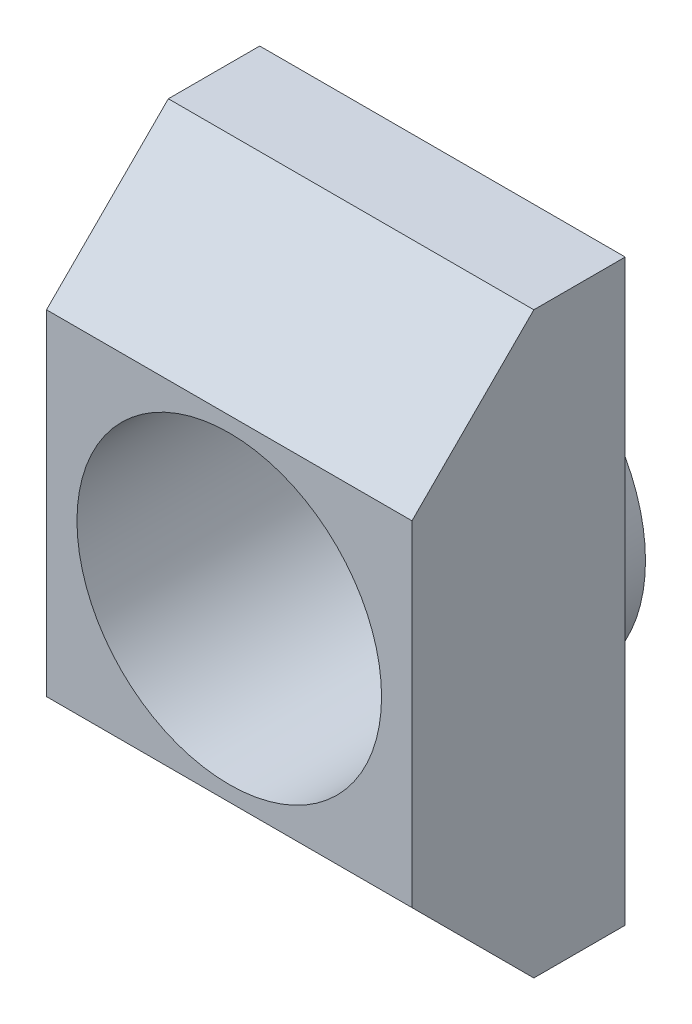
ISO-10303-21;
HEADER;
FILE_DESCRIPTION(('STEP AP214'),'2;1');
FILE_NAME('part.step','',(''),(''),'','','');
FILE_SCHEMA(('AUTOMOTIVE_DESIGN { 1 0 10303 214 1 1 1 1 }'));
ENDSEC;
DATA;
#1=APPLICATION_CONTEXT('core data for automotive mechanical design processes');
#2=APPLICATION_PROTOCOL_DEFINITION('international standard','automotive_design',2000,#1);
#3=PRODUCT_CONTEXT('',#1,'mechanical');
#4=PRODUCT('Part','Part','',(#3));
#5=PRODUCT_RELATED_PRODUCT_CATEGORY('part','',(#4));
#6=PRODUCT_DEFINITION_FORMATION('','',#4);
#7=PRODUCT_DEFINITION_CONTEXT('part definition',#1,'design');
#8=PRODUCT_DEFINITION('design','',#6,#7);
#9=PRODUCT_DEFINITION_SHAPE('','',#8);
#10=(LENGTH_UNIT() NAMED_UNIT(*) SI_UNIT(.MILLI.,.METRE.));
#11=(NAMED_UNIT(*) PLANE_ANGLE_UNIT() SI_UNIT($,.RADIAN.));
#12=(NAMED_UNIT(*) SI_UNIT($,.STERADIAN.) SOLID_ANGLE_UNIT());
#13=UNCERTAINTY_MEASURE_WITH_UNIT(LENGTH_MEASURE(1.E-05),#10,'distance_accuracy_value','');
#14=(GEOMETRIC_REPRESENTATION_CONTEXT(3) GLOBAL_UNCERTAINTY_ASSIGNED_CONTEXT((#13)) GLOBAL_UNIT_ASSIGNED_CONTEXT((#10,
#11,#12)) REPRESENTATION_CONTEXT('',''));
#15=CARTESIAN_POINT('',(0.,0.,0.));
#16=DIRECTION('',(0.,0.,1.));
#17=DIRECTION('',(1.,0.,0.));
#18=AXIS2_PLACEMENT_3D('',#15,#16,#17);
#19=CARTESIAN_POINT('',(0.,0.,2.92902435330802));
#20=DIRECTION('',(0.,0.,-1.));
#21=DIRECTION('',(-1.,0.,0.));
#22=AXIS2_PLACEMENT_3D('',#19,#20,#21);
#23=CYLINDRICAL_SURFACE('',#22,2.5);
#24=CARTESIAN_POINT('',(0.,0.,-1.4372505879018));
#25=DIRECTION('',(0.,0.,-1.));
#26=DIRECTION('',(-1.,0.,0.));
#27=AXIS2_PLACEMENT_3D('',#24,#25,#26);
#28=CIRCLE('',#27,2.5);
#29=CARTESIAN_POINT('',(-2.5,0.,-1.4372505879018));
#30=VERTEX_POINT('',#29);
#31=EDGE_CURVE('E84',#30,#30,#28,.F.);
#32=ORIENTED_EDGE('',*,*,#31,.F.);
#33=EDGE_LOOP('',(#32));
#34=FACE_BOUND('',#33,.T.);
#35=CARTESIAN_POINT('',(0.,0.,2.6627494120982));
#36=DIRECTION('',(0.,0.,-1.));
#37=DIRECTION('',(-1.,0.,0.));
#38=AXIS2_PLACEMENT_3D('',#35,#36,#37);
#39=CIRCLE('',#38,2.5);
#40=CARTESIAN_POINT('',(-2.5,0.,2.6627494120982));
#41=VERTEX_POINT('',#40);
#42=EDGE_CURVE('E20',#41,#41,#39,.F.);
#43=ORIENTED_EDGE('',*,*,#42,.T.);
#44=EDGE_LOOP('',(#43));
#45=FACE_BOUND('',#44,.T.);
#46=ADVANCED_FACE('F17',(#34,#45),#23,.F.);
#47=CARTESIAN_POINT('',(3.,4.75,0.662749412098202));
#48=DIRECTION('',(0.,-0.707106781186548,-0.707106781186548));
#49=DIRECTION('',(0.,0.707106781186548,-0.707106781186548));
#50=AXIS2_PLACEMENT_3D('',#47,#48,#49);
#51=PLANE('',#50);
#52=DIRECTION('',(-1.,0.,0.));
#53=VECTOR('',#52,1.);
#54=CARTESIAN_POINT('',(3.,2.75,2.6627494120982));
#55=LINE('',#54,#53);
#56=CARTESIAN_POINT('',(-3.,2.75,2.6627494120982));
#57=VERTEX_POINT('',#56);
#58=CARTESIAN_POINT('',(3.,2.75,2.6627494120982));
#59=VERTEX_POINT('',#58);
#60=EDGE_CURVE('E103',#57,#59,#55,.F.);
#61=ORIENTED_EDGE('',*,*,#60,.T.);
#62=DIRECTION('',(0.,-0.707106781186548,0.707106781186547));
#63=VECTOR('',#62,1.);
#64=CARTESIAN_POINT('',(3.,4.75,0.662749412098202));
#65=LINE('',#64,#63);
#66=CARTESIAN_POINT('',(3.,4.75,0.662749412098202));
#67=VERTEX_POINT('',#66);
#68=EDGE_CURVE('E67',#67,#59,#65,.T.);
#69=ORIENTED_EDGE('',*,*,#68,.F.);
#70=DIRECTION('',(1.,0.,0.));
#71=VECTOR('',#70,1.);
#72=CARTESIAN_POINT('',(3.,4.75,0.662749412098202));
#73=LINE('',#72,#71);
#74=CARTESIAN_POINT('',(-3.,4.75,0.662749412098202));
#75=VERTEX_POINT('',#74);
#76=EDGE_CURVE('E229',#67,#75,#73,.F.);
#77=ORIENTED_EDGE('',*,*,#76,.T.);
#78=DIRECTION('',(0.,-0.707106781186548,0.707106781186547));
#79=VECTOR('',#78,1.);
#80=CARTESIAN_POINT('',(-3.,4.75,0.662749412098202));
#81=LINE('',#80,#79);
#82=EDGE_CURVE('E238',#75,#57,#81,.T.);
#83=ORIENTED_EDGE('',*,*,#82,.T.);
#84=EDGE_LOOP('',(#61,#69,#77,#83));
#85=FACE_BOUND('',#84,.T.);
#86=ADVANCED_FACE('F116',(#85),#51,.F.);
#87=CARTESIAN_POINT('',(3.,2.75,2.6627494120982));
#88=DIRECTION('',(0.,0.,-1.));
#89=DIRECTION('',(-1.,0.,0.));
#90=AXIS2_PLACEMENT_3D('',#87,#88,#89);
#91=PLANE('',#90);
#92=DIRECTION('',(1.,0.,0.));
#93=VECTOR('',#92,1.);
#94=CARTESIAN_POINT('',(3.,-2.75,2.6627494120982));
#95=LINE('',#94,#93);
#96=CARTESIAN_POINT('',(-3.,-2.75,2.6627494120982));
#97=VERTEX_POINT('',#96);
#98=CARTESIAN_POINT('',(3.,-2.75,2.6627494120982));
#99=VERTEX_POINT('',#98);
#100=EDGE_CURVE('E101',#97,#99,#95,.T.);
#101=ORIENTED_EDGE('',*,*,#100,.T.);
#102=DIRECTION('',(0.,1.,0.));
#103=VECTOR('',#102,1.);
#104=CARTESIAN_POINT('',(3.,0.,2.6627494120982));
#105=LINE('',#104,#103);
#106=EDGE_CURVE('E90',#59,#99,#105,.F.);
#107=ORIENTED_EDGE('',*,*,#106,.F.);
#108=ORIENTED_EDGE('',*,*,#60,.F.);
#109=DIRECTION('',(0.,1.,0.));
#110=VECTOR('',#109,1.);
#111=CARTESIAN_POINT('',(-3.,0.,2.6627494120982));
#112=LINE('',#111,#110);
#113=EDGE_CURVE('E240',#57,#97,#112,.F.);
#114=ORIENTED_EDGE('',*,*,#113,.T.);
#115=EDGE_LOOP('',(#101,#107,#108,#114));
#116=FACE_BOUND('',#115,.T.);
#117=ORIENTED_EDGE('',*,*,#42,.F.);
#118=EDGE_LOOP('',(#117));
#119=FACE_BOUND('',#118,.T.);
#120=ADVANCED_FACE('F120',(#116,#119),#91,.F.);
#121=CARTESIAN_POINT('',(3.,-2.75,2.6627494120982));
#122=DIRECTION('',(0.,0.707106781186548,-0.707106781186548));
#123=DIRECTION('',(0.,0.707106781186548,0.707106781186548));
#124=AXIS2_PLACEMENT_3D('',#121,#122,#123);
#125=PLANE('',#124);
#126=DIRECTION('',(1.,0.,0.));
#127=VECTOR('',#126,1.);
#128=CARTESIAN_POINT('',(3.,-4.75,0.662749412098202));
#129=LINE('',#128,#127);
#130=CARTESIAN_POINT('',(-3.,-4.75,0.662749412098201));
#131=VERTEX_POINT('',#130);
#132=CARTESIAN_POINT('',(3.,-4.75,0.662749412098202));
#133=VERTEX_POINT('',#132);
#134=EDGE_CURVE('E73',#131,#133,#129,.T.);
#135=ORIENTED_EDGE('',*,*,#134,.T.);
#136=DIRECTION('',(0.,-0.707106781186548,-0.707106781186547));
#137=VECTOR('',#136,1.);
#138=CARTESIAN_POINT('',(3.,-2.75,2.6627494120982));
#139=LINE('',#138,#137);
#140=EDGE_CURVE('E76',#99,#133,#139,.T.);
#141=ORIENTED_EDGE('',*,*,#140,.F.);
#142=ORIENTED_EDGE('',*,*,#100,.F.);
#143=DIRECTION('',(0.,-0.707106781186548,-0.707106781186547));
#144=VECTOR('',#143,1.);
#145=CARTESIAN_POINT('',(-3.,-2.75,2.6627494120982));
#146=LINE('',#145,#144);
#147=EDGE_CURVE('E78',#97,#131,#146,.T.);
#148=ORIENTED_EDGE('',*,*,#147,.T.);
#149=EDGE_LOOP('',(#135,#141,#142,#148));
#150=FACE_BOUND('',#149,.T.);
#151=ADVANCED_FACE('F75',(#150),#125,.F.);
#152=CARTESIAN_POINT('',(0.,0.,-1.4372505879018));
#153=DIRECTION('',(0.,0.,-1.));
#154=DIRECTION('',(-1.,0.,0.));
#155=AXIS2_PLACEMENT_3D('',#152,#153,#154);
#156=PLANE('',#155);
#157=ORIENTED_EDGE('',*,*,#31,.T.);
#158=EDGE_LOOP('',(#157));
#159=FACE_BOUND('',#158,.T.);
#160=CARTESIAN_POINT('',(0.,0.,-1.4372505879018));
#161=DIRECTION('',(0.,0.,1.));
#162=DIRECTION('',(1.,0.,0.));
#163=AXIS2_PLACEMENT_3D('',#160,#161,#162);
#164=CIRCLE('',#163,2.7329159209683);
#165=CARTESIAN_POINT('',(2.7329159209683,0.,-1.4372505879018));
#166=VERTEX_POINT('',#165);
#167=EDGE_CURVE('E105',#166,#166,#164,.T.);
#168=ORIENTED_EDGE('',*,*,#167,.F.);
#169=EDGE_LOOP('',(#168));
#170=FACE_BOUND('',#169,.T.);
#171=ADVANCED_FACE('F111',(#159,#170),#156,.T.);
#172=CARTESIAN_POINT('',(3.,-4.75,0.662749412098202));
#173=DIRECTION('',(0.,1.,0.));
#174=DIRECTION('',(0.,0.,1.));
#175=AXIS2_PLACEMENT_3D('',#172,#173,#174);
#176=PLANE('',#175);
#177=DIRECTION('',(1.,0.,0.));
#178=VECTOR('',#177,1.);
#179=CARTESIAN_POINT('',(3.,-4.75,-0.837250587901798));
#180=LINE('',#179,#178);
#181=CARTESIAN_POINT('',(-3.,-4.75,-0.837250587901798));
#182=VERTEX_POINT('',#181);
#183=CARTESIAN_POINT('',(3.,-4.75,-0.837250587901798));
#184=VERTEX_POINT('',#183);
#185=EDGE_CURVE('E96',#182,#184,#180,.T.);
#186=ORIENTED_EDGE('',*,*,#185,.T.);
#187=DIRECTION('',(0.,0.,-1.));
#188=VECTOR('',#187,1.);
#189=CARTESIAN_POINT('',(3.,-4.75,0.));
#190=LINE('',#189,#188);
#191=EDGE_CURVE('E83',#133,#184,#190,.T.);
#192=ORIENTED_EDGE('',*,*,#191,.F.);
#193=ORIENTED_EDGE('',*,*,#134,.F.);
#194=DIRECTION('',(0.,0.,-1.));
#195=VECTOR('',#194,1.);
#196=CARTESIAN_POINT('',(-3.,-4.75,0.));
#197=LINE('',#196,#195);
#198=EDGE_CURVE('E107',#131,#182,#197,.T.);
#199=ORIENTED_EDGE('',*,*,#198,.T.);
#200=EDGE_LOOP('',(#186,#192,#193,#199));
#201=FACE_BOUND('',#200,.T.);
#202=ADVANCED_FACE('F95',(#201),#176,.F.);
#203=CARTESIAN_POINT('',(3.,0.,0.));
#204=DIRECTION('',(1.,0.,0.));
#205=DIRECTION('',(0.,0.,-1.));
#206=AXIS2_PLACEMENT_3D('',#203,#204,#205);
#207=PLANE('',#206);
#208=ORIENTED_EDGE('',*,*,#106,.T.);
#209=ORIENTED_EDGE('',*,*,#140,.T.);
#210=ORIENTED_EDGE('',*,*,#191,.T.);
#211=DIRECTION('',(0.,1.,0.));
#212=VECTOR('',#211,1.);
#213=CARTESIAN_POINT('',(3.,-4.75,-0.837250587901798));
#214=LINE('',#213,#212);
#215=CARTESIAN_POINT('',(3.,4.75,-0.837250587901798));
#216=VERTEX_POINT('',#215);
#217=EDGE_CURVE('E234',#184,#216,#214,.T.);
#218=ORIENTED_EDGE('',*,*,#217,.T.);
#219=DIRECTION('',(0.,0.,-1.));
#220=VECTOR('',#219,1.);
#221=CARTESIAN_POINT('',(3.,4.75,-0.837250587901798));
#222=LINE('',#221,#220);
#223=EDGE_CURVE('E92',#216,#67,#222,.F.);
#224=ORIENTED_EDGE('',*,*,#223,.T.);
#225=ORIENTED_EDGE('',*,*,#68,.T.);
#226=EDGE_LOOP('',(#208,#209,#210,#218,#224,#225));
#227=FACE_BOUND('',#226,.T.);
#228=ADVANCED_FACE('F86',(#227),#207,.T.);
#229=CARTESIAN_POINT('',(3.,4.75,-0.837250587901798));
#230=DIRECTION('',(0.,-1.,0.));
#231=DIRECTION('',(0.,0.,-1.));
#232=AXIS2_PLACEMENT_3D('',#229,#230,#231);
#233=PLANE('',#232);
#234=ORIENTED_EDGE('',*,*,#76,.F.);
#235=ORIENTED_EDGE('',*,*,#223,.F.);
#236=DIRECTION('',(1.,0.,0.));
#237=VECTOR('',#236,1.);
#238=CARTESIAN_POINT('',(3.,4.75,-0.837250587901798));
#239=LINE('',#238,#237);
#240=CARTESIAN_POINT('',(-3.,4.75,-0.837250587901798));
#241=VERTEX_POINT('',#240);
#242=EDGE_CURVE('E247',#216,#241,#239,.F.);
#243=ORIENTED_EDGE('',*,*,#242,.T.);
#244=DIRECTION('',(0.,0.,-1.));
#245=VECTOR('',#244,1.);
#246=CARTESIAN_POINT('',(-3.,4.75,0.));
#247=LINE('',#246,#245);
#248=EDGE_CURVE('E35',#241,#75,#247,.F.);
#249=ORIENTED_EDGE('',*,*,#248,.T.);
#250=EDGE_LOOP('',(#234,#235,#243,#249));
#251=FACE_BOUND('',#250,.T.);
#252=ADVANCED_FACE('F147',(#251),#233,.F.);
#253=CARTESIAN_POINT('',(-3.,0.,0.));
#254=DIRECTION('',(1.,0.,0.));
#255=DIRECTION('',(0.,0.,-1.));
#256=AXIS2_PLACEMENT_3D('',#253,#254,#255);
#257=PLANE('',#256);
#258=ORIENTED_EDGE('',*,*,#147,.F.);
#259=ORIENTED_EDGE('',*,*,#113,.F.);
#260=ORIENTED_EDGE('',*,*,#82,.F.);
#261=ORIENTED_EDGE('',*,*,#248,.F.);
#262=DIRECTION('',(0.,1.,0.));
#263=VECTOR('',#262,1.);
#264=CARTESIAN_POINT('',(-3.,-4.75,-0.837250587901798));
#265=LINE('',#264,#263);
#266=EDGE_CURVE('E26',#241,#182,#265,.F.);
#267=ORIENTED_EDGE('',*,*,#266,.T.);
#268=ORIENTED_EDGE('',*,*,#198,.F.);
#269=EDGE_LOOP('',(#258,#259,#260,#261,#267,#268));
#270=FACE_BOUND('',#269,.T.);
#271=ADVANCED_FACE('F139',(#270),#257,.F.);
#272=CARTESIAN_POINT('',(0.,0.,-1.4372505879018));
#273=DIRECTION('',(0.,0.,1.));
#274=DIRECTION('',(1.,0.,0.));
#275=AXIS2_PLACEMENT_3D('',#272,#273,#274);
#276=CYLINDRICAL_SURFACE('',#275,2.7329159209683);
#277=ORIENTED_EDGE('',*,*,#167,.T.);
#278=EDGE_LOOP('',(#277));
#279=FACE_BOUND('',#278,.T.);
#280=CARTESIAN_POINT('',(0.,0.,-0.837250587901798));
#281=DIRECTION('',(0.,0.,1.));
#282=DIRECTION('',(1.,0.,0.));
#283=AXIS2_PLACEMENT_3D('',#280,#281,#282);
#284=CIRCLE('',#283,2.7329159209683);
#285=CARTESIAN_POINT('',(2.7329159209683,0.,-0.837250587901798));
#286=VERTEX_POINT('',#285);
#287=EDGE_CURVE('E10',#286,#286,#284,.F.);
#288=ORIENTED_EDGE('',*,*,#287,.T.);
#289=EDGE_LOOP('',(#288));
#290=FACE_BOUND('',#289,.T.);
#291=ADVANCED_FACE('F133',(#279,#290),#276,.T.);
#292=CARTESIAN_POINT('',(3.,-4.75,-0.837250587901798));
#293=DIRECTION('',(0.,0.,1.));
#294=DIRECTION('',(1.,0.,0.));
#295=AXIS2_PLACEMENT_3D('',#292,#293,#294);
#296=PLANE('',#295);
#297=ORIENTED_EDGE('',*,*,#287,.F.);
#298=EDGE_LOOP('',(#297));
#299=FACE_BOUND('',#298,.T.);
#300=ORIENTED_EDGE('',*,*,#242,.F.);
#301=ORIENTED_EDGE('',*,*,#217,.F.);
#302=ORIENTED_EDGE('',*,*,#185,.F.);
#303=ORIENTED_EDGE('',*,*,#266,.F.);
#304=EDGE_LOOP('',(#300,#301,#302,#303));
#305=FACE_BOUND('',#304,.T.);
#306=ADVANCED_FACE('F131',(#299,#305),#296,.F.);
#307=CLOSED_SHELL('',(#46,#86,#120,#151,#171,#202,#228,#252,#271,#291,#306));
#308=MANIFOLD_SOLID_BREP('B1',#307);
#309=ADVANCED_BREP_SHAPE_REPRESENTATION('',(#18,#308),#14);
#310=SHAPE_DEFINITION_REPRESENTATION(#9,#309);
ENDSEC;
END-ISO-10303-21;
